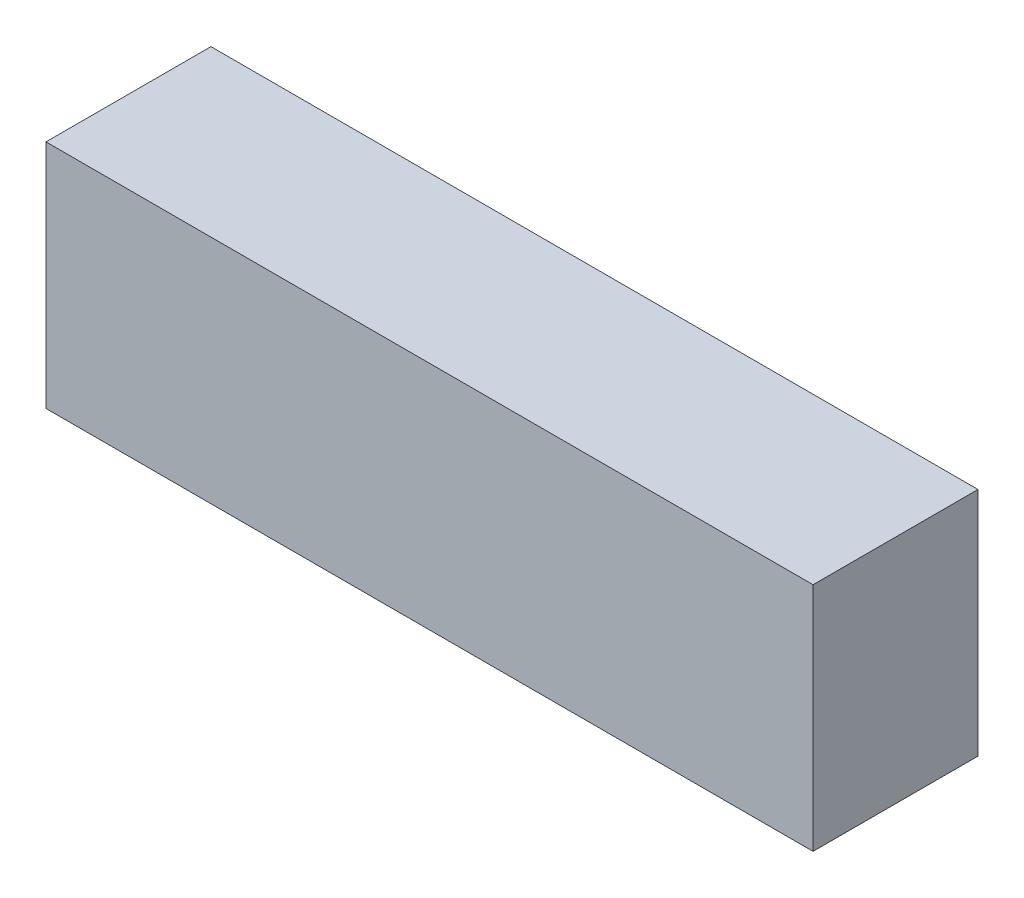
ISO-10303-21;
HEADER;
FILE_DESCRIPTION(('STEP AP214'),'2;1');
FILE_NAME('part.step','',(''),(''),'','','');
FILE_SCHEMA(('AUTOMOTIVE_DESIGN { 1 0 10303 214 1 1 1 1 }'));
ENDSEC;
DATA;
#1=APPLICATION_CONTEXT('core data for automotive mechanical design processes');
#2=APPLICATION_PROTOCOL_DEFINITION('international standard','automotive_design',2000,#1);
#3=PRODUCT_CONTEXT('',#1,'mechanical');
#4=PRODUCT('Part','Part','',(#3));
#5=PRODUCT_RELATED_PRODUCT_CATEGORY('part','',(#4));
#6=PRODUCT_DEFINITION_FORMATION('','',#4);
#7=PRODUCT_DEFINITION_CONTEXT('part definition',#1,'design');
#8=PRODUCT_DEFINITION('design','',#6,#7);
#9=PRODUCT_DEFINITION_SHAPE('','',#8);
#10=(LENGTH_UNIT() NAMED_UNIT(*) SI_UNIT(.MILLI.,.METRE.));
#11=(NAMED_UNIT(*) PLANE_ANGLE_UNIT() SI_UNIT($,.RADIAN.));
#12=(NAMED_UNIT(*) SI_UNIT($,.STERADIAN.) SOLID_ANGLE_UNIT());
#13=UNCERTAINTY_MEASURE_WITH_UNIT(LENGTH_MEASURE(1.E-05),#10,'distance_accuracy_value','');
#14=(GEOMETRIC_REPRESENTATION_CONTEXT(3) GLOBAL_UNCERTAINTY_ASSIGNED_CONTEXT((#13)) GLOBAL_UNIT_ASSIGNED_CONTEXT((#10,
#11,#12)) REPRESENTATION_CONTEXT('',''));
#15=CARTESIAN_POINT('',(0.,0.,0.));
#16=DIRECTION('',(0.,0.,1.));
#17=DIRECTION('',(1.,0.,0.));
#18=AXIS2_PLACEMENT_3D('',#15,#16,#17);
#19=CARTESIAN_POINT('',(46.5,14.,20.));
#20=DIRECTION('',(-1.,0.,0.));
#21=DIRECTION('',(0.,0.,1.));
#22=AXIS2_PLACEMENT_3D('',#19,#20,#21);
#23=PLANE('',#22);
#24=DIRECTION('',(0.,1.,0.));
#25=VECTOR('',#24,1.);
#26=CARTESIAN_POINT('',(46.5,14.,0.));
#27=LINE('',#26,#25);
#28=CARTESIAN_POINT('',(46.5,-14.,0.));
#29=VERTEX_POINT('',#28);
#30=CARTESIAN_POINT('',(46.5,14.,0.));
#31=VERTEX_POINT('',#30);
#32=EDGE_CURVE('E107',#29,#31,#27,.T.);
#33=ORIENTED_EDGE('',*,*,#32,.T.);
#34=DIRECTION('',(0.,0.,-1.));
#35=VECTOR('',#34,1.);
#36=CARTESIAN_POINT('',(46.5,14.,20.));
#37=LINE('',#36,#35);
#38=CARTESIAN_POINT('',(46.5,14.,20.));
#39=VERTEX_POINT('',#38);
#40=EDGE_CURVE('E11',#39,#31,#37,.T.);
#41=ORIENTED_EDGE('',*,*,#40,.F.);
#42=DIRECTION('',(0.,1.,0.));
#43=VECTOR('',#42,1.);
#44=CARTESIAN_POINT('',(46.5,14.,20.));
#45=LINE('',#44,#43);
#46=CARTESIAN_POINT('',(46.5,-14.,20.));
#47=VERTEX_POINT('',#46);
#48=EDGE_CURVE('E91',#47,#39,#45,.T.);
#49=ORIENTED_EDGE('',*,*,#48,.F.);
#50=DIRECTION('',(0.,0.,-1.));
#51=VECTOR('',#50,1.);
#52=CARTESIAN_POINT('',(46.5,-14.,20.));
#53=LINE('',#52,#51);
#54=EDGE_CURVE('E103',#47,#29,#53,.T.);
#55=ORIENTED_EDGE('',*,*,#54,.T.);
#56=EDGE_LOOP('',(#33,#41,#49,#55));
#57=FACE_BOUND('',#56,.T.);
#58=ADVANCED_FACE('F39',(#57),#23,.F.);
#59=CARTESIAN_POINT('',(-46.5,14.,20.));
#60=DIRECTION('',(0.,-1.,0.));
#61=DIRECTION('',(1.,0.,0.));
#62=AXIS2_PLACEMENT_3D('',#59,#60,#61);
#63=PLANE('',#62);
#64=DIRECTION('',(-1.,0.,0.));
#65=VECTOR('',#64,1.);
#66=CARTESIAN_POINT('',(-46.5,14.,0.));
#67=LINE('',#66,#65);
#68=CARTESIAN_POINT('',(-46.5,14.,0.));
#69=VERTEX_POINT('',#68);
#70=EDGE_CURVE('E96',#31,#69,#67,.T.);
#71=ORIENTED_EDGE('',*,*,#70,.T.);
#72=DIRECTION('',(0.,0.,-1.));
#73=VECTOR('',#72,1.);
#74=CARTESIAN_POINT('',(-46.5,14.,20.));
#75=LINE('',#74,#73);
#76=CARTESIAN_POINT('',(-46.5,14.,20.));
#77=VERTEX_POINT('',#76);
#78=EDGE_CURVE('E48',#77,#69,#75,.T.);
#79=ORIENTED_EDGE('',*,*,#78,.F.);
#80=DIRECTION('',(-1.,0.,0.));
#81=VECTOR('',#80,1.);
#82=CARTESIAN_POINT('',(-46.5,14.,20.));
#83=LINE('',#82,#81);
#84=EDGE_CURVE('E86',#39,#77,#83,.T.);
#85=ORIENTED_EDGE('',*,*,#84,.F.);
#86=ORIENTED_EDGE('',*,*,#40,.T.);
#87=EDGE_LOOP('',(#71,#79,#85,#86));
#88=FACE_BOUND('',#87,.T.);
#89=ADVANCED_FACE('F95',(#88),#63,.F.);
#90=CARTESIAN_POINT('',(-46.5,14.,20.));
#91=DIRECTION('',(1.,0.,0.));
#92=DIRECTION('',(0.,1.,0.));
#93=AXIS2_PLACEMENT_3D('',#90,#91,#92);
#94=PLANE('',#93);
#95=DIRECTION('',(0.,-1.,0.));
#96=VECTOR('',#95,1.);
#97=CARTESIAN_POINT('',(-46.5,14.,0.));
#98=LINE('',#97,#96);
#99=CARTESIAN_POINT('',(-46.5,-14.,0.));
#100=VERTEX_POINT('',#99);
#101=EDGE_CURVE('E73',#69,#100,#98,.T.);
#102=ORIENTED_EDGE('',*,*,#101,.T.);
#103=DIRECTION('',(0.,0.,-1.));
#104=VECTOR('',#103,1.);
#105=CARTESIAN_POINT('',(-46.5,-14.,20.));
#106=LINE('',#105,#104);
#107=CARTESIAN_POINT('',(-46.5,-14.,20.));
#108=VERTEX_POINT('',#107);
#109=EDGE_CURVE('E98',#108,#100,#106,.T.);
#110=ORIENTED_EDGE('',*,*,#109,.F.);
#111=DIRECTION('',(0.,-1.,0.));
#112=VECTOR('',#111,1.);
#113=CARTESIAN_POINT('',(-46.5,14.,20.));
#114=LINE('',#113,#112);
#115=EDGE_CURVE('E89',#77,#108,#114,.T.);
#116=ORIENTED_EDGE('',*,*,#115,.F.);
#117=ORIENTED_EDGE('',*,*,#78,.T.);
#118=EDGE_LOOP('',(#102,#110,#116,#117));
#119=FACE_BOUND('',#118,.T.);
#120=ADVANCED_FACE('F99',(#119),#94,.F.);
#121=CARTESIAN_POINT('',(-46.5,-14.,20.));
#122=DIRECTION('',(0.,1.,0.));
#123=DIRECTION('',(-1.,0.,0.));
#124=AXIS2_PLACEMENT_3D('',#121,#122,#123);
#125=PLANE('',#124);
#126=DIRECTION('',(1.,0.,0.));
#127=VECTOR('',#126,1.);
#128=CARTESIAN_POINT('',(-46.5,-14.,0.));
#129=LINE('',#128,#127);
#130=EDGE_CURVE('E79',#100,#29,#129,.T.);
#131=ORIENTED_EDGE('',*,*,#130,.T.);
#132=ORIENTED_EDGE('',*,*,#54,.F.);
#133=DIRECTION('',(1.,0.,0.));
#134=VECTOR('',#133,1.);
#135=CARTESIAN_POINT('',(-46.5,-14.,20.));
#136=LINE('',#135,#134);
#137=EDGE_CURVE('E56',#108,#47,#136,.T.);
#138=ORIENTED_EDGE('',*,*,#137,.F.);
#139=ORIENTED_EDGE('',*,*,#109,.T.);
#140=EDGE_LOOP('',(#131,#132,#138,#139));
#141=FACE_BOUND('',#140,.T.);
#142=ADVANCED_FACE('F120',(#141),#125,.F.);
#143=CARTESIAN_POINT('',(0.,0.,20.));
#144=DIRECTION('',(0.,0.,1.));
#145=DIRECTION('',(1.,0.,0.));
#146=AXIS2_PLACEMENT_3D('',#143,#144,#145);
#147=PLANE('',#146);
#148=ORIENTED_EDGE('',*,*,#48,.T.);
#149=ORIENTED_EDGE('',*,*,#84,.T.);
#150=ORIENTED_EDGE('',*,*,#115,.T.);
#151=ORIENTED_EDGE('',*,*,#137,.T.);
#152=EDGE_LOOP('',(#148,#149,#150,#151));
#153=FACE_BOUND('',#152,.T.);
#154=ADVANCED_FACE('F87',(#153),#147,.T.);
#155=CARTESIAN_POINT('',(0.,0.,0.));
#156=DIRECTION('',(0.,0.,1.));
#157=DIRECTION('',(1.,0.,0.));
#158=AXIS2_PLACEMENT_3D('',#155,#156,#157);
#159=PLANE('',#158);
#160=ORIENTED_EDGE('',*,*,#32,.F.);
#161=ORIENTED_EDGE('',*,*,#130,.F.);
#162=ORIENTED_EDGE('',*,*,#101,.F.);
#163=ORIENTED_EDGE('',*,*,#70,.F.);
#164=EDGE_LOOP('',(#160,#161,#162,#163));
#165=FACE_BOUND('',#164,.T.);
#166=ADVANCED_FACE('F123',(#165),#159,.F.);
#167=CLOSED_SHELL('',(#58,#89,#120,#142,#154,#166));
#168=MANIFOLD_SOLID_BREP('B2',#167);
#169=ADVANCED_BREP_SHAPE_REPRESENTATION('',(#18,#168),#14);
#170=SHAPE_DEFINITION_REPRESENTATION(#9,#169);
ENDSEC;
END-ISO-10303-21;
